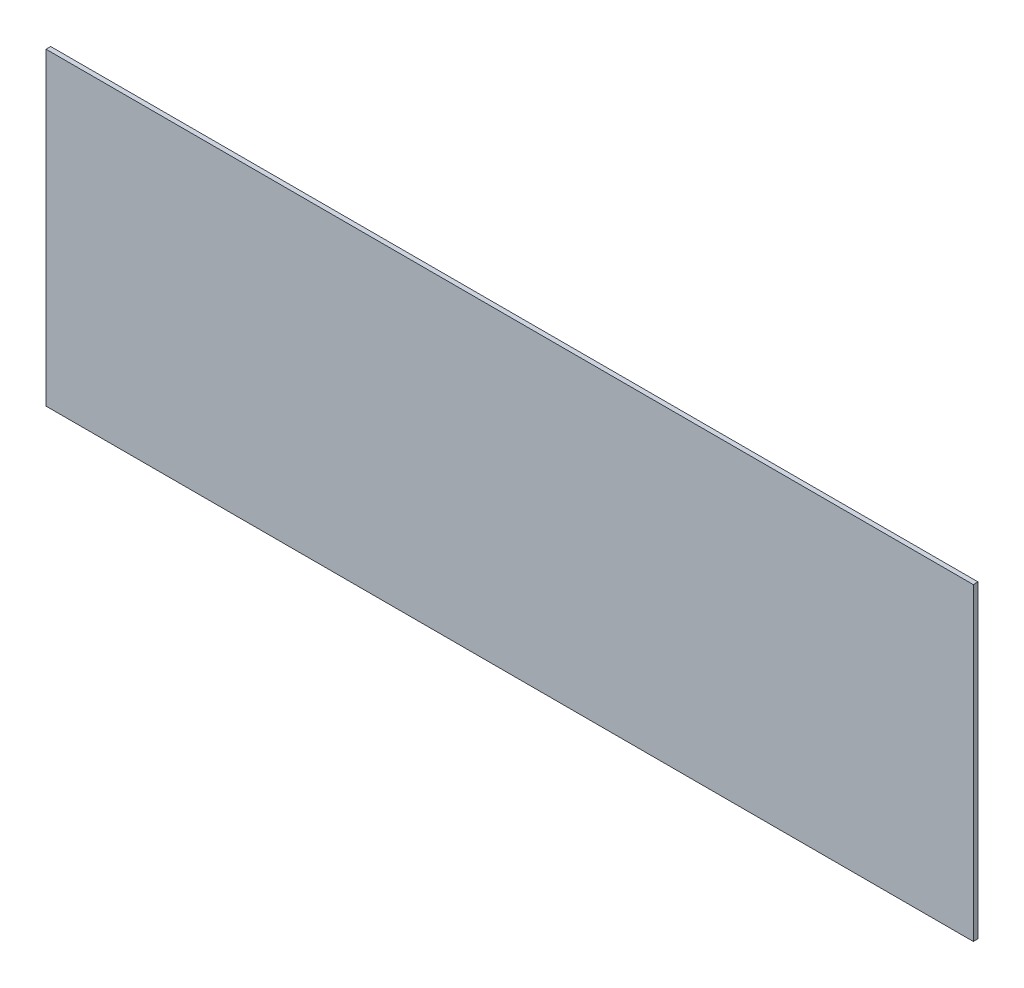
ISO-10303-21;
HEADER;
FILE_DESCRIPTION(('STEP AP214'),'2;1');
FILE_NAME('part.step','',(''),(''),'','','');
FILE_SCHEMA(('AUTOMOTIVE_DESIGN { 1 0 10303 214 1 1 1 1 }'));
ENDSEC;
DATA;
#1=APPLICATION_CONTEXT('core data for automotive mechanical design processes');
#2=APPLICATION_PROTOCOL_DEFINITION('international standard','automotive_design',2000,#1);
#3=PRODUCT_CONTEXT('',#1,'mechanical');
#4=PRODUCT('Part','Part','',(#3));
#5=PRODUCT_RELATED_PRODUCT_CATEGORY('part','',(#4));
#6=PRODUCT_DEFINITION_FORMATION('','',#4);
#7=PRODUCT_DEFINITION_CONTEXT('part definition',#1,'design');
#8=PRODUCT_DEFINITION('design','',#6,#7);
#9=PRODUCT_DEFINITION_SHAPE('','',#8);
#10=(LENGTH_UNIT() NAMED_UNIT(*) SI_UNIT(.MILLI.,.METRE.));
#11=(NAMED_UNIT(*) PLANE_ANGLE_UNIT() SI_UNIT($,.RADIAN.));
#12=(NAMED_UNIT(*) SI_UNIT($,.STERADIAN.) SOLID_ANGLE_UNIT());
#13=UNCERTAINTY_MEASURE_WITH_UNIT(LENGTH_MEASURE(1.E-05),#10,'distance_accuracy_value','');
#14=(GEOMETRIC_REPRESENTATION_CONTEXT(3) GLOBAL_UNCERTAINTY_ASSIGNED_CONTEXT((#13)) GLOBAL_UNIT_ASSIGNED_CONTEXT((#10,
#11,#12)) REPRESENTATION_CONTEXT('',''));
#15=CARTESIAN_POINT('',(0.,0.,0.));
#16=DIRECTION('',(0.,0.,1.));
#17=DIRECTION('',(1.,0.,0.));
#18=AXIS2_PLACEMENT_3D('',#15,#16,#17);
#19=CARTESIAN_POINT('',(2251.33979615078,470.523405665144,223.998189395739));
#20=DIRECTION('',(-1.,0.,0.));
#21=DIRECTION('',(0.,0.,1.));
#22=AXIS2_PLACEMENT_3D('',#19,#20,#21);
#23=PLANE('',#22);
#24=DIRECTION('',(0.,-1.,0.));
#25=VECTOR('',#24,1.);
#26=CARTESIAN_POINT('',(2251.33979615078,470.523405665144,230.348189395739));
#27=LINE('',#26,#25);
#28=CARTESIAN_POINT('',(2251.33979615078,470.523405665144,230.348189395739));
#29=VERTEX_POINT('',#28);
#30=CARTESIAN_POINT('',(2251.33979615078,51.4234111197023,230.348189395739));
#31=VERTEX_POINT('',#30);
#32=EDGE_CURVE('E96',#29,#31,#27,.T.);
#33=ORIENTED_EDGE('',*,*,#32,.T.);
#34=DIRECTION('',(0.,0.,1.));
#35=VECTOR('',#34,1.);
#36=CARTESIAN_POINT('',(2251.33979615078,51.4234111197023,223.998189395739));
#37=LINE('',#36,#35);
#38=CARTESIAN_POINT('',(2251.33979615078,51.4234111197023,223.998189395739));
#39=VERTEX_POINT('',#38);
#40=EDGE_CURVE('E11',#39,#31,#37,.T.);
#41=ORIENTED_EDGE('',*,*,#40,.F.);
#42=DIRECTION('',(0.,-1.,0.));
#43=VECTOR('',#42,1.);
#44=CARTESIAN_POINT('',(2251.33979615078,470.523405665144,223.998189395739));
#45=LINE('',#44,#43);
#46=CARTESIAN_POINT('',(2251.33979615078,470.523405665144,223.998189395739));
#47=VERTEX_POINT('',#46);
#48=EDGE_CURVE('E84',#47,#39,#45,.T.);
#49=ORIENTED_EDGE('',*,*,#48,.F.);
#50=DIRECTION('',(0.,0.,1.));
#51=VECTOR('',#50,1.);
#52=CARTESIAN_POINT('',(2251.33979615078,470.523405665144,223.998189395739));
#53=LINE('',#52,#51);
#54=EDGE_CURVE('E92',#47,#29,#53,.T.);
#55=ORIENTED_EDGE('',*,*,#54,.T.);
#56=EDGE_LOOP('',(#33,#41,#49,#55));
#57=FACE_BOUND('',#56,.T.);
#58=ADVANCED_FACE('F33',(#57),#23,.F.);
#59=CARTESIAN_POINT('',(2251.33979615078,51.4234111197023,223.998189395739));
#60=DIRECTION('',(0.,1.,0.));
#61=DIRECTION('',(0.,0.,1.));
#62=AXIS2_PLACEMENT_3D('',#59,#60,#61);
#63=PLANE('',#62);
#64=DIRECTION('',(-1.,0.,0.));
#65=VECTOR('',#64,1.);
#66=CARTESIAN_POINT('',(2251.33979615078,51.4234111197023,230.348189395739));
#67=LINE('',#66,#65);
#68=CARTESIAN_POINT('',(994.039798453397,51.4234111197023,230.348189395739));
#69=VERTEX_POINT('',#68);
#70=EDGE_CURVE('E88',#31,#69,#67,.T.);
#71=ORIENTED_EDGE('',*,*,#70,.T.);
#72=DIRECTION('',(0.,0.,1.));
#73=VECTOR('',#72,1.);
#74=CARTESIAN_POINT('',(994.039798453397,51.4234111197023,223.998189395739));
#75=LINE('',#74,#73);
#76=CARTESIAN_POINT('',(994.039798453397,51.4234111197023,223.998189395739));
#77=VERTEX_POINT('',#76);
#78=EDGE_CURVE('E41',#77,#69,#75,.T.);
#79=ORIENTED_EDGE('',*,*,#78,.F.);
#80=DIRECTION('',(-1.,0.,0.));
#81=VECTOR('',#80,1.);
#82=CARTESIAN_POINT('',(2251.33979615078,51.4234111197023,223.998189395739));
#83=LINE('',#82,#81);
#84=EDGE_CURVE('E79',#39,#77,#83,.T.);
#85=ORIENTED_EDGE('',*,*,#84,.F.);
#86=ORIENTED_EDGE('',*,*,#40,.T.);
#87=EDGE_LOOP('',(#71,#79,#85,#86));
#88=FACE_BOUND('',#87,.T.);
#89=ADVANCED_FACE('F87',(#88),#63,.F.);
#90=CARTESIAN_POINT('',(994.039798453397,470.523405665144,223.998189395739));
#91=DIRECTION('',(1.,0.,0.));
#92=DIRECTION('',(0.,0.,-1.));
#93=AXIS2_PLACEMENT_3D('',#90,#91,#92);
#94=PLANE('',#93);
#95=DIRECTION('',(0.,1.,0.));
#96=VECTOR('',#95,1.);
#97=CARTESIAN_POINT('',(994.039798453397,470.523405665144,230.348189395739));
#98=LINE('',#97,#96);
#99=CARTESIAN_POINT('',(994.039798453397,470.523405665144,230.348189395739));
#100=VERTEX_POINT('',#99);
#101=EDGE_CURVE('E66',#69,#100,#98,.T.);
#102=ORIENTED_EDGE('',*,*,#101,.T.);
#103=DIRECTION('',(0.,0.,1.));
#104=VECTOR('',#103,1.);
#105=CARTESIAN_POINT('',(994.039798453397,470.523405665144,223.998189395739));
#106=LINE('',#105,#104);
#107=CARTESIAN_POINT('',(994.039798453397,470.523405665144,223.998189395739));
#108=VERTEX_POINT('',#107);
#109=EDGE_CURVE('E89',#108,#100,#106,.T.);
#110=ORIENTED_EDGE('',*,*,#109,.F.);
#111=DIRECTION('',(0.,1.,0.));
#112=VECTOR('',#111,1.);
#113=CARTESIAN_POINT('',(994.039798453397,470.523405665144,223.998189395739));
#114=LINE('',#113,#112);
#115=EDGE_CURVE('E82',#77,#108,#114,.T.);
#116=ORIENTED_EDGE('',*,*,#115,.F.);
#117=ORIENTED_EDGE('',*,*,#78,.T.);
#118=EDGE_LOOP('',(#102,#110,#116,#117));
#119=FACE_BOUND('',#118,.T.);
#120=ADVANCED_FACE('F90',(#119),#94,.F.);
#121=CARTESIAN_POINT('',(2251.33979615078,470.523405665144,223.998189395739));
#122=DIRECTION('',(0.,-1.,0.));
#123=DIRECTION('',(0.,0.,-1.));
#124=AXIS2_PLACEMENT_3D('',#121,#122,#123);
#125=PLANE('',#124);
#126=DIRECTION('',(1.,0.,0.));
#127=VECTOR('',#126,1.);
#128=CARTESIAN_POINT('',(2251.33979615078,470.523405665144,230.348189395739));
#129=LINE('',#128,#127);
#130=EDGE_CURVE('E72',#100,#29,#129,.T.);
#131=ORIENTED_EDGE('',*,*,#130,.T.);
#132=ORIENTED_EDGE('',*,*,#54,.F.);
#133=DIRECTION('',(1.,0.,0.));
#134=VECTOR('',#133,1.);
#135=CARTESIAN_POINT('',(2251.33979615078,470.523405665144,223.998189395739));
#136=LINE('',#135,#134);
#137=EDGE_CURVE('E49',#108,#47,#136,.T.);
#138=ORIENTED_EDGE('',*,*,#137,.F.);
#139=ORIENTED_EDGE('',*,*,#109,.T.);
#140=EDGE_LOOP('',(#131,#132,#138,#139));
#141=FACE_BOUND('',#140,.T.);
#142=ADVANCED_FACE('F103',(#141),#125,.F.);
#143=CARTESIAN_POINT('',(0.,0.,223.998189395739));
#144=DIRECTION('',(0.,0.,-1.));
#145=DIRECTION('',(-1.,0.,0.));
#146=AXIS2_PLACEMENT_3D('',#143,#144,#145);
#147=PLANE('',#146);
#148=ORIENTED_EDGE('',*,*,#48,.T.);
#149=ORIENTED_EDGE('',*,*,#84,.T.);
#150=ORIENTED_EDGE('',*,*,#115,.T.);
#151=ORIENTED_EDGE('',*,*,#137,.T.);
#152=EDGE_LOOP('',(#148,#149,#150,#151));
#153=FACE_BOUND('',#152,.T.);
#154=ADVANCED_FACE('F80',(#153),#147,.T.);
#155=CARTESIAN_POINT('',(0.,0.,230.348189395739));
#156=DIRECTION('',(0.,0.,-1.));
#157=DIRECTION('',(-1.,0.,0.));
#158=AXIS2_PLACEMENT_3D('',#155,#156,#157);
#159=PLANE('',#158);
#160=ORIENTED_EDGE('',*,*,#32,.F.);
#161=ORIENTED_EDGE('',*,*,#130,.F.);
#162=ORIENTED_EDGE('',*,*,#101,.F.);
#163=ORIENTED_EDGE('',*,*,#70,.F.);
#164=EDGE_LOOP('',(#160,#161,#162,#163));
#165=FACE_BOUND('',#164,.T.);
#166=ADVANCED_FACE('F106',(#165),#159,.F.);
#167=CLOSED_SHELL('',(#58,#89,#120,#142,#154,#166));
#168=MANIFOLD_SOLID_BREP('B2',#167);
#169=ADVANCED_BREP_SHAPE_REPRESENTATION('',(#18,#168),#14);
#170=SHAPE_DEFINITION_REPRESENTATION(#9,#169);
ENDSEC;
END-ISO-10303-21;
